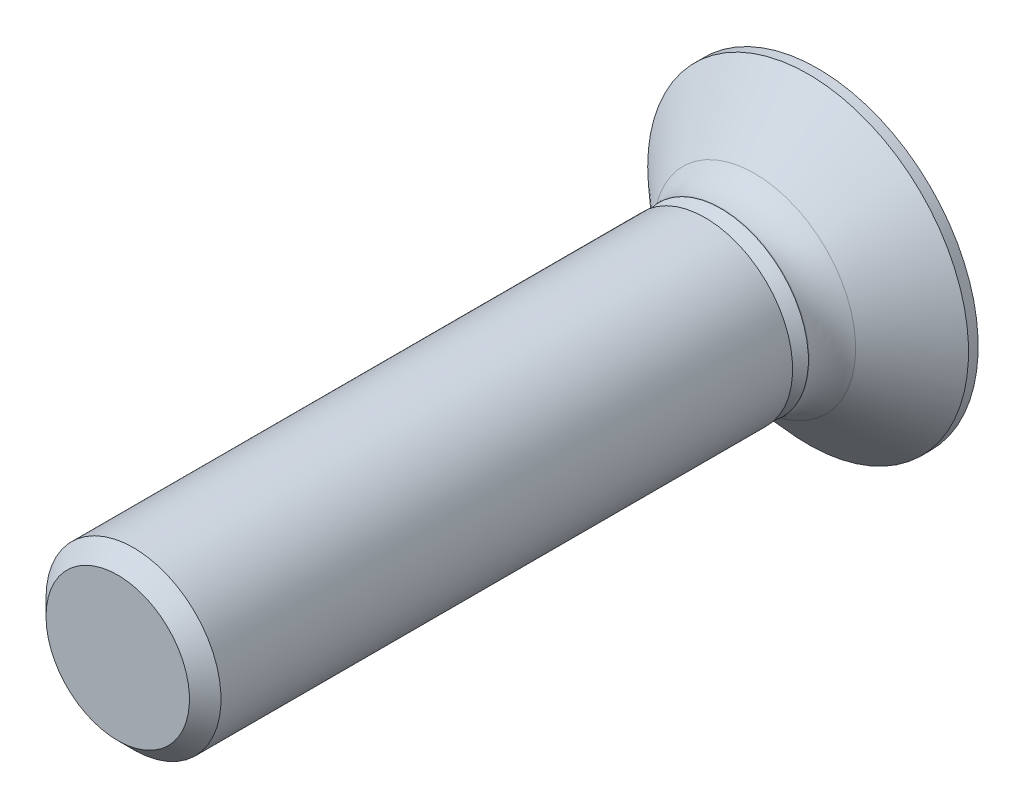
ISO-10303-21;
HEADER;
FILE_DESCRIPTION(('STEP AP214'),'2;1');
FILE_NAME('part.step','',(''),(''),'','','');
FILE_SCHEMA(('AUTOMOTIVE_DESIGN { 1 0 10303 214 1 1 1 1 }'));
ENDSEC;
DATA;
#1=APPLICATION_CONTEXT('core data for automotive mechanical design processes');
#2=APPLICATION_PROTOCOL_DEFINITION('international standard','automotive_design',2000,#1);
#3=PRODUCT_CONTEXT('',#1,'mechanical');
#4=PRODUCT('Part','Part','',(#3));
#5=PRODUCT_RELATED_PRODUCT_CATEGORY('part','',(#4));
#6=PRODUCT_DEFINITION_FORMATION('','',#4);
#7=PRODUCT_DEFINITION_CONTEXT('part definition',#1,'design');
#8=PRODUCT_DEFINITION('design','',#6,#7);
#9=PRODUCT_DEFINITION_SHAPE('','',#8);
#10=(LENGTH_UNIT() NAMED_UNIT(*) SI_UNIT(.MILLI.,.METRE.));
#11=(NAMED_UNIT(*) PLANE_ANGLE_UNIT() SI_UNIT($,.RADIAN.));
#12=(NAMED_UNIT(*) SI_UNIT($,.STERADIAN.) SOLID_ANGLE_UNIT());
#13=UNCERTAINTY_MEASURE_WITH_UNIT(LENGTH_MEASURE(1.E-05),#10,'distance_accuracy_value','');
#14=(GEOMETRIC_REPRESENTATION_CONTEXT(3) GLOBAL_UNCERTAINTY_ASSIGNED_CONTEXT((#13)) GLOBAL_UNIT_ASSIGNED_CONTEXT((#10,
#11,#12)) REPRESENTATION_CONTEXT('',''));
#15=CARTESIAN_POINT('',(0.,0.,0.));
#16=DIRECTION('',(0.,0.,1.));
#17=DIRECTION('',(1.,0.,0.));
#18=AXIS2_PLACEMENT_3D('',#15,#16,#17);
#19=CARTESIAN_POINT('',(0.,2.75,0.));
#20=DIRECTION('',(0.,0.,1.));
#21=DIRECTION('',(1.,0.,0.));
#22=AXIS2_PLACEMENT_3D('',#19,#20,#21);
#23=PLANE('',#22);
#24=CARTESIAN_POINT('',(0.,0.,0.));
#25=DIRECTION('',(0.,0.,-1.));
#26=DIRECTION('',(-1.,0.,0.));
#27=AXIS2_PLACEMENT_3D('',#24,#25,#26);
#28=CIRCLE('',#27,2.75);
#29=CARTESIAN_POINT('',(-2.75,0.,0.));
#30=VERTEX_POINT('',#29);
#31=EDGE_CURVE('E115',#30,#30,#28,.T.);
#32=ORIENTED_EDGE('',*,*,#31,.T.);
#33=EDGE_LOOP('',(#32));
#34=FACE_BOUND('',#33,.T.);
#35=DIRECTION('',(1.,0.,0.));
#36=VECTOR('',#35,1.);
#37=CARTESIAN_POINT('',(-0.475,-1.525,0.));
#38=LINE('',#37,#36);
#39=CARTESIAN_POINT('',(-0.475,-1.525,0.));
#40=VERTEX_POINT('',#39);
#41=CARTESIAN_POINT('',(0.275,-1.525,0.));
#42=VERTEX_POINT('',#41);
#43=EDGE_CURVE('E30',#40,#42,#38,.T.);
#44=ORIENTED_EDGE('',*,*,#43,.T.);
#45=DIRECTION('',(0.,1.,0.));
#46=VECTOR('',#45,1.);
#47=CARTESIAN_POINT('',(0.275,-1.525,0.));
#48=LINE('',#47,#46);
#49=CARTESIAN_POINT('',(0.275,-0.4,0.));
#50=VERTEX_POINT('',#49);
#51=EDGE_CURVE('E348',#42,#50,#48,.T.);
#52=ORIENTED_EDGE('',*,*,#51,.T.);
#53=DIRECTION('',(1.,0.,0.));
#54=VECTOR('',#53,1.);
#55=CARTESIAN_POINT('',(0.275,-0.4,0.));
#56=LINE('',#55,#54);
#57=CARTESIAN_POINT('',(1.4,-0.4,0.));
#58=VERTEX_POINT('',#57);
#59=EDGE_CURVE('E353',#50,#58,#56,.T.);
#60=ORIENTED_EDGE('',*,*,#59,.T.);
#61=DIRECTION('',(0.,1.,0.));
#62=VECTOR('',#61,1.);
#63=CARTESIAN_POINT('',(1.4,-0.4,0.));
#64=LINE('',#63,#62);
#65=CARTESIAN_POINT('',(1.4,0.35,0.));
#66=VERTEX_POINT('',#65);
#67=EDGE_CURVE('E358',#58,#66,#64,.T.);
#68=ORIENTED_EDGE('',*,*,#67,.T.);
#69=DIRECTION('',(-1.,0.,0.));
#70=VECTOR('',#69,1.);
#71=CARTESIAN_POINT('',(1.4,0.35,0.));
#72=LINE('',#71,#70);
#73=CARTESIAN_POINT('',(0.275,0.35,0.));
#74=VERTEX_POINT('',#73);
#75=EDGE_CURVE('E363',#66,#74,#72,.T.);
#76=ORIENTED_EDGE('',*,*,#75,.T.);
#77=DIRECTION('',(0.,1.,0.));
#78=VECTOR('',#77,1.);
#79=CARTESIAN_POINT('',(0.275,0.35,0.));
#80=LINE('',#79,#78);
#81=CARTESIAN_POINT('',(0.275,1.475,0.));
#82=VERTEX_POINT('',#81);
#83=EDGE_CURVE('E368',#74,#82,#80,.T.);
#84=ORIENTED_EDGE('',*,*,#83,.T.);
#85=DIRECTION('',(-1.,0.,0.));
#86=VECTOR('',#85,1.);
#87=CARTESIAN_POINT('',(0.275,1.475,0.));
#88=LINE('',#87,#86);
#89=CARTESIAN_POINT('',(-0.475,1.475,0.));
#90=VERTEX_POINT('',#89);
#91=EDGE_CURVE('E373',#82,#90,#88,.T.);
#92=ORIENTED_EDGE('',*,*,#91,.T.);
#93=DIRECTION('',(0.,-1.,0.));
#94=VECTOR('',#93,1.);
#95=CARTESIAN_POINT('',(-0.475,1.475,0.));
#96=LINE('',#95,#94);
#97=CARTESIAN_POINT('',(-0.475,0.35,0.));
#98=VERTEX_POINT('',#97);
#99=EDGE_CURVE('E378',#90,#98,#96,.T.);
#100=ORIENTED_EDGE('',*,*,#99,.T.);
#101=DIRECTION('',(-1.,0.,0.));
#102=VECTOR('',#101,1.);
#103=CARTESIAN_POINT('',(-0.475,0.35,0.));
#104=LINE('',#103,#102);
#105=CARTESIAN_POINT('',(-1.6,0.35,0.));
#106=VERTEX_POINT('',#105);
#107=EDGE_CURVE('E383',#98,#106,#104,.T.);
#108=ORIENTED_EDGE('',*,*,#107,.T.);
#109=DIRECTION('',(0.,-1.,0.));
#110=VECTOR('',#109,1.);
#111=CARTESIAN_POINT('',(-1.6,0.35,0.));
#112=LINE('',#111,#110);
#113=CARTESIAN_POINT('',(-1.6,-0.4,0.));
#114=VERTEX_POINT('',#113);
#115=EDGE_CURVE('E388',#106,#114,#112,.T.);
#116=ORIENTED_EDGE('',*,*,#115,.T.);
#117=DIRECTION('',(1.,0.,0.));
#118=VECTOR('',#117,1.);
#119=CARTESIAN_POINT('',(-1.6,-0.4,0.));
#120=LINE('',#119,#118);
#121=CARTESIAN_POINT('',(-0.475,-0.4,0.));
#122=VERTEX_POINT('',#121);
#123=EDGE_CURVE('E97',#114,#122,#120,.T.);
#124=ORIENTED_EDGE('',*,*,#123,.T.);
#125=DIRECTION('',(0.,-1.,0.));
#126=VECTOR('',#125,1.);
#127=CARTESIAN_POINT('',(-0.475,-0.4,0.));
#128=LINE('',#127,#126);
#129=EDGE_CURVE('E395',#122,#40,#128,.T.);
#130=ORIENTED_EDGE('',*,*,#129,.T.);
#131=EDGE_LOOP('',(#44,#52,#60,#68,#76,#84,#92,#100,#108,#116,#124,#130));
#132=FACE_BOUND('',#131,.T.);
#133=ADVANCED_FACE('F15',(#34,#132),#23,.F.);
#134=CARTESIAN_POINT('',(0.,0.,12.));
#135=DIRECTION('',(0.,0.,-1.));
#136=DIRECTION('',(-1.,0.,0.));
#137=AXIS2_PLACEMENT_3D('',#134,#135,#136);
#138=PLANE('',#137);
#139=CARTESIAN_POINT('',(0.,0.,12.));
#140=DIRECTION('',(0.,0.,-1.));
#141=DIRECTION('',(-1.,0.,0.));
#142=AXIS2_PLACEMENT_3D('',#139,#140,#141);
#143=CIRCLE('',#142,1.229375);
#144=CARTESIAN_POINT('',(-1.229375,0.,12.));
#145=VERTEX_POINT('',#144);
#146=EDGE_CURVE('E10',#145,#145,#143,.T.);
#147=ORIENTED_EDGE('',*,*,#146,.F.);
#148=EDGE_LOOP('',(#147));
#149=FACE_BOUND('',#148,.T.);
#150=ADVANCED_FACE('F155',(#149),#138,.F.);
#151=CARTESIAN_POINT('',(0.,0.,12.));
#152=DIRECTION('',(0.,0.,-1.));
#153=DIRECTION('',(-1.,0.,0.));
#154=AXIS2_PLACEMENT_3D('',#151,#152,#153);
#155=CONICAL_SURFACE('',#154,1.229375,0.785398163397449);
#156=CARTESIAN_POINT('',(0.,0.,11.729375));
#157=DIRECTION('',(0.,0.,-1.));
#158=DIRECTION('',(-1.,0.,0.));
#159=AXIS2_PLACEMENT_3D('',#156,#157,#158);
#160=CIRCLE('',#159,1.5);
#161=CARTESIAN_POINT('',(-1.5,0.,11.729375));
#162=VERTEX_POINT('',#161);
#163=EDGE_CURVE('E23',#162,#162,#160,.T.);
#164=ORIENTED_EDGE('',*,*,#163,.F.);
#165=EDGE_LOOP('',(#164));
#166=FACE_BOUND('',#165,.T.);
#167=ORIENTED_EDGE('',*,*,#146,.T.);
#168=EDGE_LOOP('',(#167));
#169=FACE_BOUND('',#168,.T.);
#170=ADVANCED_FACE('F152',(#166,#169),#155,.T.);
#171=CARTESIAN_POINT('',(0.,0.,0.));
#172=DIRECTION('',(0.,0.,-1.));
#173=DIRECTION('',(-1.,0.,0.));
#174=AXIS2_PLACEMENT_3D('',#171,#172,#173);
#175=CYLINDRICAL_SURFACE('',#174,1.5);
#176=CARTESIAN_POINT('',(0.,0.,1.930625));
#177=DIRECTION('',(0.,0.,-1.));
#178=DIRECTION('',(-1.,0.,0.));
#179=AXIS2_PLACEMENT_3D('',#176,#177,#178);
#180=CIRCLE('',#179,1.5);
#181=CARTESIAN_POINT('',(-1.5,0.,1.930625));
#182=VERTEX_POINT('',#181);
#183=EDGE_CURVE('E140',#182,#182,#180,.T.);
#184=ORIENTED_EDGE('',*,*,#183,.F.);
#185=EDGE_LOOP('',(#184));
#186=FACE_BOUND('',#185,.T.);
#187=ORIENTED_EDGE('',*,*,#163,.T.);
#188=EDGE_LOOP('',(#187));
#189=FACE_BOUND('',#188,.T.);
#190=ADVANCED_FACE('F150',(#186,#189),#175,.T.);
#191=CARTESIAN_POINT('',(0.,1.5,1.930625));
#192=DIRECTION('',(0.,0.,1.));
#193=DIRECTION('',(1.,0.,0.));
#194=AXIS2_PLACEMENT_3D('',#191,#192,#193);
#195=PLANE('',#194);
#196=CARTESIAN_POINT('',(0.,0.,1.930625));
#197=DIRECTION('',(0.,0.,-1.));
#198=DIRECTION('',(-1.,0.,0.));
#199=AXIS2_PLACEMENT_3D('',#196,#197,#198);
#200=CIRCLE('',#199,1.229375);
#201=CARTESIAN_POINT('',(-1.229375,0.,1.930625));
#202=VERTEX_POINT('',#201);
#203=EDGE_CURVE('E136',#202,#202,#200,.T.);
#204=ORIENTED_EDGE('',*,*,#203,.F.);
#205=EDGE_LOOP('',(#204));
#206=FACE_BOUND('',#205,.T.);
#207=ORIENTED_EDGE('',*,*,#183,.T.);
#208=EDGE_LOOP('',(#207));
#209=FACE_BOUND('',#208,.T.);
#210=ADVANCED_FACE('F168',(#206,#209),#195,.F.);
#211=CARTESIAN_POINT('',(0.,0.,1.930625));
#212=DIRECTION('',(0.,0.,-1.));
#213=DIRECTION('',(-1.,0.,0.));
#214=AXIS2_PLACEMENT_3D('',#211,#212,#213);
#215=CONICAL_SURFACE('',#214,1.229375,0.785398163397449);
#216=CARTESIAN_POINT('',(0.,0.,1.66));
#217=DIRECTION('',(0.,0.,-1.));
#218=DIRECTION('',(-1.,0.,0.));
#219=AXIS2_PLACEMENT_3D('',#216,#217,#218);
#220=CIRCLE('',#219,1.5);
#221=CARTESIAN_POINT('',(-1.5,0.,1.66));
#222=VERTEX_POINT('',#221);
#223=EDGE_CURVE('E132',#222,#222,#220,.T.);
#224=ORIENTED_EDGE('',*,*,#223,.F.);
#225=EDGE_LOOP('',(#224));
#226=FACE_BOUND('',#225,.T.);
#227=ORIENTED_EDGE('',*,*,#203,.T.);
#228=EDGE_LOOP('',(#227));
#229=FACE_BOUND('',#228,.T.);
#230=ADVANCED_FACE('F172',(#226,#229),#215,.T.);
#231=CARTESIAN_POINT('',(0.,0.,0.));
#232=DIRECTION('',(0.,0.,-1.));
#233=DIRECTION('',(-1.,0.,0.));
#234=AXIS2_PLACEMENT_3D('',#231,#232,#233);
#235=CYLINDRICAL_SURFACE('',#234,1.5);
#236=CARTESIAN_POINT('',(0.,0.,1.65));
#237=DIRECTION('',(0.,0.,-1.));
#238=DIRECTION('',(-1.,0.,0.));
#239=AXIS2_PLACEMENT_3D('',#236,#237,#238);
#240=CIRCLE('',#239,1.5);
#241=CARTESIAN_POINT('',(-1.5,0.,1.65));
#242=VERTEX_POINT('',#241);
#243=EDGE_CURVE('E128',#242,#242,#240,.T.);
#244=ORIENTED_EDGE('',*,*,#243,.F.);
#245=EDGE_LOOP('',(#244));
#246=FACE_BOUND('',#245,.T.);
#247=ORIENTED_EDGE('',*,*,#223,.T.);
#248=EDGE_LOOP('',(#247));
#249=FACE_BOUND('',#248,.T.);
#250=ADVANCED_FACE('F176',(#246,#249),#235,.T.);
#251=CARTESIAN_POINT('',(0.,0.,1.65));
#252=DIRECTION('',(0.,0.,-1.));
#253=DIRECTION('',(-1.,0.,0.));
#254=AXIS2_PLACEMENT_3D('',#251,#252,#253);
#255=TOROIDAL_SURFACE('',#254,2.3,0.8);
#256=ORIENTED_EDGE('',*,*,#243,.T.);
#257=EDGE_LOOP('',(#256));
#258=FACE_BOUND('',#257,.T.);
#259=CARTESIAN_POINT('',(0.,0.,1.08431457505076));
#260=DIRECTION('',(0.,0.,-1.));
#261=DIRECTION('',(-1.,0.,0.));
#262=AXIS2_PLACEMENT_3D('',#259,#260,#261);
#263=CIRCLE('',#262,1.73431457505076);
#264=CARTESIAN_POINT('',(-1.73431457505076,0.,1.08431457505076));
#265=VERTEX_POINT('',#264);
#266=EDGE_CURVE('E124',#265,#265,#263,.T.);
#267=ORIENTED_EDGE('',*,*,#266,.F.);
#268=EDGE_LOOP('',(#267));
#269=FACE_BOUND('',#268,.T.);
#270=ADVANCED_FACE('F180',(#258,#269),#255,.F.);
#271=CARTESIAN_POINT('',(0.,0.,1.08431457505076));
#272=DIRECTION('',(0.,0.,-1.));
#273=DIRECTION('',(-1.,0.,0.));
#274=AXIS2_PLACEMENT_3D('',#271,#272,#273);
#275=CONICAL_SURFACE('',#274,1.73431457505076,0.835161102643237);
#276=CARTESIAN_POINT('',(0.,0.,0.165));
#277=DIRECTION('',(0.,0.,-1.));
#278=DIRECTION('',(-1.,0.,0.));
#279=AXIS2_PLACEMENT_3D('',#276,#277,#278);
#280=CIRCLE('',#279,2.75);
#281=CARTESIAN_POINT('',(-2.75,0.,0.165));
#282=VERTEX_POINT('',#281);
#283=EDGE_CURVE('E119',#282,#282,#280,.T.);
#284=ORIENTED_EDGE('',*,*,#283,.F.);
#285=EDGE_LOOP('',(#284));
#286=FACE_BOUND('',#285,.T.);
#287=ORIENTED_EDGE('',*,*,#266,.T.);
#288=EDGE_LOOP('',(#287));
#289=FACE_BOUND('',#288,.T.);
#290=ADVANCED_FACE('F184',(#286,#289),#275,.T.);
#291=CARTESIAN_POINT('',(0.,0.,0.));
#292=DIRECTION('',(0.,0.,-1.));
#293=DIRECTION('',(-1.,0.,0.));
#294=AXIS2_PLACEMENT_3D('',#291,#292,#293);
#295=CYLINDRICAL_SURFACE('',#294,2.75);
#296=ORIENTED_EDGE('',*,*,#31,.F.);
#297=EDGE_LOOP('',(#296));
#298=FACE_BOUND('',#297,.T.);
#299=ORIENTED_EDGE('',*,*,#283,.T.);
#300=EDGE_LOOP('',(#299));
#301=FACE_BOUND('',#300,.T.);
#302=ADVANCED_FACE('F188',(#298,#301),#295,.T.);
#303=CARTESIAN_POINT('',(-0.475,-1.525,0.));
#304=DIRECTION('',(0.,-0.984807753012208,0.17364817766693));
#305=DIRECTION('',(0.,-0.17364817766693,-0.984807753012208));
#306=AXIS2_PLACEMENT_3D('',#303,#304,#305);
#307=PLANE('',#306);
#308=ORIENTED_EDGE('',*,*,#43,.F.);
#309=DIRECTION('',(-0.171087869746036,-0.171087869746036,-0.970287525247814));
#310=VECTOR('',#309,1.);
#311=CARTESIAN_POINT('',(-0.475,-1.525,0.));
#312=LINE('',#311,#310);
#313=CARTESIAN_POINT('',(-0.164664513953102,-1.2146645139531,1.76));
#314=VERTEX_POINT('',#313);
#315=EDGE_CURVE('E111',#314,#40,#312,.T.);
#316=ORIENTED_EDGE('',*,*,#315,.F.);
#317=DIRECTION('',(-1.,0.,0.));
#318=VECTOR('',#317,1.);
#319=CARTESIAN_POINT('',(-0.475,-1.2146645139531,1.76));
#320=LINE('',#319,#318);
#321=CARTESIAN_POINT('',(-0.0353354860468985,-1.2146645139531,1.76));
#322=VERTEX_POINT('',#321);
#323=EDGE_CURVE('E399',#314,#322,#320,.F.);
#324=ORIENTED_EDGE('',*,*,#323,.T.);
#325=DIRECTION('',(0.171087869746036,-0.171087869746036,-0.970287525247814));
#326=VECTOR('',#325,1.);
#327=CARTESIAN_POINT('',(0.275,-1.525,0.));
#328=LINE('',#327,#326);
#329=EDGE_CURVE('E120',#322,#42,#328,.T.);
#330=ORIENTED_EDGE('',*,*,#329,.T.);
#331=EDGE_LOOP('',(#308,#316,#324,#330));
#332=FACE_BOUND('',#331,.T.);
#333=ADVANCED_FACE('F192',(#332),#307,.F.);
#334=CARTESIAN_POINT('',(0.275,-1.525,0.));
#335=DIRECTION('',(0.984807753012208,0.,0.17364817766693));
#336=DIRECTION('',(0.17364817766693,0.,-0.984807753012208));
#337=AXIS2_PLACEMENT_3D('',#334,#335,#336);
#338=PLANE('',#337);
#339=ORIENTED_EDGE('',*,*,#51,.F.);
#340=ORIENTED_EDGE('',*,*,#329,.F.);
#341=DIRECTION('',(0.,-1.,0.));
#342=VECTOR('',#341,1.);
#343=CARTESIAN_POINT('',(-0.0353354860468988,-1.525,1.76));
#344=LINE('',#343,#342);
#345=CARTESIAN_POINT('',(-0.0353354860468985,-0.0896645139531017,1.76));
#346=VERTEX_POINT('',#345);
#347=EDGE_CURVE('E408',#322,#346,#344,.F.);
#348=ORIENTED_EDGE('',*,*,#347,.T.);
#349=DIRECTION('',(0.171087869746036,-0.171087869746036,-0.970287525247814));
#350=VECTOR('',#349,1.);
#351=CARTESIAN_POINT('',(0.307929941571016,-0.432929941571016,-0.186754978952777));
#352=LINE('',#351,#350);
#353=EDGE_CURVE('E440',#346,#50,#352,.T.);
#354=ORIENTED_EDGE('',*,*,#353,.T.);
#355=EDGE_LOOP('',(#339,#340,#348,#354));
#356=FACE_BOUND('',#355,.T.);
#357=ADVANCED_FACE('F196',(#356),#338,.F.);
#358=CARTESIAN_POINT('',(0.275,-0.4,0.));
#359=DIRECTION('',(0.,-0.984807753012208,0.17364817766693));
#360=DIRECTION('',(0.,-0.17364817766693,-0.984807753012208));
#361=AXIS2_PLACEMENT_3D('',#358,#359,#360);
#362=PLANE('',#361);
#363=ORIENTED_EDGE('',*,*,#59,.F.);
#364=ORIENTED_EDGE('',*,*,#353,.F.);
#365=DIRECTION('',(-1.,0.,0.));
#366=VECTOR('',#365,1.);
#367=CARTESIAN_POINT('',(0.275,-0.0896645139531017,1.76));
#368=LINE('',#367,#366);
#369=CARTESIAN_POINT('',(1.0896645139531,-0.0896645139531017,1.76));
#370=VERTEX_POINT('',#369);
#371=EDGE_CURVE('E448',#346,#370,#368,.F.);
#372=ORIENTED_EDGE('',*,*,#371,.T.);
#373=DIRECTION('',(0.171087869746036,-0.171087869746036,-0.970287525247814));
#374=VECTOR('',#373,1.);
#375=CARTESIAN_POINT('',(1.4,-0.4,0.));
#376=LINE('',#375,#374);
#377=EDGE_CURVE('E436',#370,#58,#376,.T.);
#378=ORIENTED_EDGE('',*,*,#377,.T.);
#379=EDGE_LOOP('',(#363,#364,#372,#378));
#380=FACE_BOUND('',#379,.T.);
#381=ADVANCED_FACE('F199',(#380),#362,.F.);
#382=CARTESIAN_POINT('',(1.4,-0.4,0.));
#383=DIRECTION('',(0.984807753012208,0.,0.17364817766693));
#384=DIRECTION('',(0.17364817766693,0.,-0.984807753012208));
#385=AXIS2_PLACEMENT_3D('',#382,#383,#384);
#386=PLANE('',#385);
#387=ORIENTED_EDGE('',*,*,#67,.F.);
#388=ORIENTED_EDGE('',*,*,#377,.F.);
#389=DIRECTION('',(0.,-1.,0.));
#390=VECTOR('',#389,1.);
#391=CARTESIAN_POINT('',(1.0896645139531,-0.4,1.76));
#392=LINE('',#391,#390);
#393=CARTESIAN_POINT('',(1.0896645139531,0.0396645139531017,1.76));
#394=VERTEX_POINT('',#393);
#395=EDGE_CURVE('E451',#370,#394,#392,.F.);
#396=ORIENTED_EDGE('',*,*,#395,.T.);
#397=DIRECTION('',(0.171087869746036,0.171087869746036,-0.970287525247814));
#398=VECTOR('',#397,1.);
#399=CARTESIAN_POINT('',(1.4,0.35,0.));
#400=LINE('',#399,#398);
#401=EDGE_CURVE('E432',#394,#66,#400,.T.);
#402=ORIENTED_EDGE('',*,*,#401,.T.);
#403=EDGE_LOOP('',(#387,#388,#396,#402));
#404=FACE_BOUND('',#403,.T.);
#405=ADVANCED_FACE('F203',(#404),#386,.F.);
#406=CARTESIAN_POINT('',(1.4,0.35,0.));
#407=DIRECTION('',(0.,0.984807753012208,0.17364817766693));
#408=DIRECTION('',(0.,-0.17364817766693,0.984807753012208));
#409=AXIS2_PLACEMENT_3D('',#406,#407,#408);
#410=PLANE('',#409);
#411=ORIENTED_EDGE('',*,*,#75,.F.);
#412=ORIENTED_EDGE('',*,*,#401,.F.);
#413=DIRECTION('',(1.,0.,0.));
#414=VECTOR('',#413,1.);
#415=CARTESIAN_POINT('',(1.4,0.0396645139531017,1.76));
#416=LINE('',#415,#414);
#417=CARTESIAN_POINT('',(-0.0353354860468985,0.0396645139531017,1.76));
#418=VERTEX_POINT('',#417);
#419=EDGE_CURVE('E454',#394,#418,#416,.F.);
#420=ORIENTED_EDGE('',*,*,#419,.T.);
#421=DIRECTION('',(0.171087869746036,0.171087869746036,-0.970287525247814));
#422=VECTOR('',#421,1.);
#423=CARTESIAN_POINT('',(0.307929941571016,0.382929941571016,-0.186754978952777));
#424=LINE('',#423,#422);
#425=EDGE_CURVE('E428',#418,#74,#424,.T.);
#426=ORIENTED_EDGE('',*,*,#425,.T.);
#427=EDGE_LOOP('',(#411,#412,#420,#426));
#428=FACE_BOUND('',#427,.T.);
#429=ADVANCED_FACE('F207',(#428),#410,.F.);
#430=CARTESIAN_POINT('',(0.275,0.35,0.));
#431=DIRECTION('',(0.984807753012208,0.,0.17364817766693));
#432=DIRECTION('',(0.17364817766693,0.,-0.984807753012208));
#433=AXIS2_PLACEMENT_3D('',#430,#431,#432);
#434=PLANE('',#433);
#435=ORIENTED_EDGE('',*,*,#83,.F.);
#436=ORIENTED_EDGE('',*,*,#425,.F.);
#437=DIRECTION('',(0.,-1.,0.));
#438=VECTOR('',#437,1.);
#439=CARTESIAN_POINT('',(-0.0353354860468988,0.35,1.76));
#440=LINE('',#439,#438);
#441=CARTESIAN_POINT('',(-0.0353354860468985,1.1646645139531,1.76));
#442=VERTEX_POINT('',#441);
#443=EDGE_CURVE('E457',#418,#442,#440,.F.);
#444=ORIENTED_EDGE('',*,*,#443,.T.);
#445=DIRECTION('',(0.171087869746036,0.171087869746036,-0.970287525247814));
#446=VECTOR('',#445,1.);
#447=CARTESIAN_POINT('',(0.275,1.475,0.));
#448=LINE('',#447,#446);
#449=EDGE_CURVE('E424',#442,#82,#448,.T.);
#450=ORIENTED_EDGE('',*,*,#449,.T.);
#451=EDGE_LOOP('',(#435,#436,#444,#450));
#452=FACE_BOUND('',#451,.T.);
#453=ADVANCED_FACE('F211',(#452),#434,.F.);
#454=CARTESIAN_POINT('',(0.275,1.475,0.));
#455=DIRECTION('',(0.,0.984807753012208,0.17364817766693));
#456=DIRECTION('',(0.,-0.17364817766693,0.984807753012208));
#457=AXIS2_PLACEMENT_3D('',#454,#455,#456);
#458=PLANE('',#457);
#459=ORIENTED_EDGE('',*,*,#91,.F.);
#460=ORIENTED_EDGE('',*,*,#449,.F.);
#461=DIRECTION('',(1.,0.,0.));
#462=VECTOR('',#461,1.);
#463=CARTESIAN_POINT('',(0.275,1.1646645139531,1.76));
#464=LINE('',#463,#462);
#465=CARTESIAN_POINT('',(-0.164664513953102,1.1646645139531,1.76));
#466=VERTEX_POINT('',#465);
#467=EDGE_CURVE('E460',#442,#466,#464,.F.);
#468=ORIENTED_EDGE('',*,*,#467,.T.);
#469=DIRECTION('',(-0.171087869746036,0.171087869746036,-0.970287525247814));
#470=VECTOR('',#469,1.);
#471=CARTESIAN_POINT('',(-0.475,1.475,0.));
#472=LINE('',#471,#470);
#473=EDGE_CURVE('E420',#466,#90,#472,.T.);
#474=ORIENTED_EDGE('',*,*,#473,.T.);
#475=EDGE_LOOP('',(#459,#460,#468,#474));
#476=FACE_BOUND('',#475,.T.);
#477=ADVANCED_FACE('F215',(#476),#458,.F.);
#478=CARTESIAN_POINT('',(-0.475,1.475,0.));
#479=DIRECTION('',(-0.984807753012208,0.,0.17364817766693));
#480=DIRECTION('',(0.17364817766693,0.,0.984807753012208));
#481=AXIS2_PLACEMENT_3D('',#478,#479,#480);
#482=PLANE('',#481);
#483=ORIENTED_EDGE('',*,*,#99,.F.);
#484=ORIENTED_EDGE('',*,*,#473,.F.);
#485=DIRECTION('',(0.,1.,0.));
#486=VECTOR('',#485,1.);
#487=CARTESIAN_POINT('',(-0.164664513953102,1.475,1.76));
#488=LINE('',#487,#486);
#489=CARTESIAN_POINT('',(-0.164664513953102,0.0396645139531015,1.76));
#490=VERTEX_POINT('',#489);
#491=EDGE_CURVE('E463',#466,#490,#488,.F.);
#492=ORIENTED_EDGE('',*,*,#491,.T.);
#493=DIRECTION('',(-0.171087869746036,0.171087869746036,-0.970287525247814));
#494=VECTOR('',#493,1.);
#495=CARTESIAN_POINT('',(-0.507929941571016,0.382929941571016,-0.186754978952777));
#496=LINE('',#495,#494);
#497=EDGE_CURVE('E416',#490,#98,#496,.T.);
#498=ORIENTED_EDGE('',*,*,#497,.T.);
#499=EDGE_LOOP('',(#483,#484,#492,#498));
#500=FACE_BOUND('',#499,.T.);
#501=ADVANCED_FACE('F219',(#500),#482,.F.);
#502=CARTESIAN_POINT('',(-0.475,0.35,0.));
#503=DIRECTION('',(0.,0.984807753012208,0.17364817766693));
#504=DIRECTION('',(0.,-0.17364817766693,0.984807753012208));
#505=AXIS2_PLACEMENT_3D('',#502,#503,#504);
#506=PLANE('',#505);
#507=ORIENTED_EDGE('',*,*,#107,.F.);
#508=ORIENTED_EDGE('',*,*,#497,.F.);
#509=DIRECTION('',(1.,0.,0.));
#510=VECTOR('',#509,1.);
#511=CARTESIAN_POINT('',(-0.475,0.0396645139531016,1.76));
#512=LINE('',#511,#510);
#513=CARTESIAN_POINT('',(-1.2896645139531,0.0396645139531016,1.76));
#514=VERTEX_POINT('',#513);
#515=EDGE_CURVE('E91',#490,#514,#512,.F.);
#516=ORIENTED_EDGE('',*,*,#515,.T.);
#517=DIRECTION('',(-0.171087869746036,0.171087869746036,-0.970287525247814));
#518=VECTOR('',#517,1.);
#519=CARTESIAN_POINT('',(-1.6,0.35,0.));
#520=LINE('',#519,#518);
#521=EDGE_CURVE('E85',#514,#106,#520,.T.);
#522=ORIENTED_EDGE('',*,*,#521,.T.);
#523=EDGE_LOOP('',(#507,#508,#516,#522));
#524=FACE_BOUND('',#523,.T.);
#525=ADVANCED_FACE('F223',(#524),#506,.F.);
#526=CARTESIAN_POINT('',(-1.6,0.35,0.));
#527=DIRECTION('',(-0.984807753012208,0.,0.17364817766693));
#528=DIRECTION('',(0.17364817766693,0.,0.984807753012208));
#529=AXIS2_PLACEMENT_3D('',#526,#527,#528);
#530=PLANE('',#529);
#531=ORIENTED_EDGE('',*,*,#115,.F.);
#532=ORIENTED_EDGE('',*,*,#521,.F.);
#533=DIRECTION('',(0.,1.,0.));
#534=VECTOR('',#533,1.);
#535=CARTESIAN_POINT('',(-1.2896645139531,0.35,1.76));
#536=LINE('',#535,#534);
#537=CARTESIAN_POINT('',(-1.2896645139531,-0.0896645139531017,1.76));
#538=VERTEX_POINT('',#537);
#539=EDGE_CURVE('E77',#514,#538,#536,.F.);
#540=ORIENTED_EDGE('',*,*,#539,.T.);
#541=DIRECTION('',(-0.171087869746036,-0.171087869746036,-0.970287525247814));
#542=VECTOR('',#541,1.);
#543=CARTESIAN_POINT('',(-1.6,-0.4,0.));
#544=LINE('',#543,#542);
#545=EDGE_CURVE('E82',#538,#114,#544,.T.);
#546=ORIENTED_EDGE('',*,*,#545,.T.);
#547=EDGE_LOOP('',(#531,#532,#540,#546));
#548=FACE_BOUND('',#547,.T.);
#549=ADVANCED_FACE('F80',(#548),#530,.F.);
#550=CARTESIAN_POINT('',(-1.6,-0.4,0.));
#551=DIRECTION('',(0.,-0.984807753012208,0.17364817766693));
#552=DIRECTION('',(0.,-0.17364817766693,-0.984807753012208));
#553=AXIS2_PLACEMENT_3D('',#550,#551,#552);
#554=PLANE('',#553);
#555=ORIENTED_EDGE('',*,*,#123,.F.);
#556=ORIENTED_EDGE('',*,*,#545,.F.);
#557=DIRECTION('',(-1.,0.,0.));
#558=VECTOR('',#557,1.);
#559=CARTESIAN_POINT('',(-1.6,-0.0896645139531017,1.76));
#560=LINE('',#559,#558);
#561=CARTESIAN_POINT('',(-0.164664513953102,-0.0896645139531017,1.76));
#562=VERTEX_POINT('',#561);
#563=EDGE_CURVE('E90',#538,#562,#560,.F.);
#564=ORIENTED_EDGE('',*,*,#563,.T.);
#565=DIRECTION('',(-0.171087869746036,-0.171087869746036,-0.970287525247814));
#566=VECTOR('',#565,1.);
#567=CARTESIAN_POINT('',(-0.507929941571016,-0.432929941571016,-0.186754978952777));
#568=LINE('',#567,#566);
#569=EDGE_CURVE('E100',#562,#122,#568,.T.);
#570=ORIENTED_EDGE('',*,*,#569,.T.);
#571=EDGE_LOOP('',(#555,#556,#564,#570));
#572=FACE_BOUND('',#571,.T.);
#573=ADVANCED_FACE('F94',(#572),#554,.F.);
#574=CARTESIAN_POINT('',(-0.475,-0.4,0.));
#575=DIRECTION('',(-0.984807753012208,0.,0.17364817766693));
#576=DIRECTION('',(0.17364817766693,0.,0.984807753012208));
#577=AXIS2_PLACEMENT_3D('',#574,#575,#576);
#578=PLANE('',#577);
#579=ORIENTED_EDGE('',*,*,#129,.F.);
#580=ORIENTED_EDGE('',*,*,#569,.F.);
#581=DIRECTION('',(0.,1.,0.));
#582=VECTOR('',#581,1.);
#583=CARTESIAN_POINT('',(-0.164664513953102,-0.4,1.76));
#584=LINE('',#583,#582);
#585=EDGE_CURVE('E38',#562,#314,#584,.F.);
#586=ORIENTED_EDGE('',*,*,#585,.T.);
#587=ORIENTED_EDGE('',*,*,#315,.T.);
#588=EDGE_LOOP('',(#579,#580,#586,#587));
#589=FACE_BOUND('',#588,.T.);
#590=ADVANCED_FACE('F232',(#589),#578,.F.);
#591=CARTESIAN_POINT('',(0.275,-1.525,1.76));
#592=DIRECTION('',(0.,0.,1.));
#593=DIRECTION('',(1.,0.,0.));
#594=AXIS2_PLACEMENT_3D('',#591,#592,#593);
#595=PLANE('',#594);
#596=ORIENTED_EDGE('',*,*,#323,.F.);
#597=ORIENTED_EDGE('',*,*,#585,.F.);
#598=ORIENTED_EDGE('',*,*,#563,.F.);
#599=ORIENTED_EDGE('',*,*,#539,.F.);
#600=ORIENTED_EDGE('',*,*,#515,.F.);
#601=ORIENTED_EDGE('',*,*,#491,.F.);
#602=ORIENTED_EDGE('',*,*,#467,.F.);
#603=ORIENTED_EDGE('',*,*,#443,.F.);
#604=ORIENTED_EDGE('',*,*,#419,.F.);
#605=ORIENTED_EDGE('',*,*,#395,.F.);
#606=ORIENTED_EDGE('',*,*,#371,.F.);
#607=ORIENTED_EDGE('',*,*,#347,.F.);
#608=EDGE_LOOP('',(#596,#597,#598,#599,#600,#601,#602,#603,#604,#605,#606,#607));
#609=FACE_BOUND('',#608,.T.);
#610=ADVANCED_FACE('F103',(#609),#595,.F.);
#611=CLOSED_SHELL('',(#133,#150,#170,#190,#210,#230,#250,#270,#290,#302,#333,#357,#381,#405,
#429,#453,#477,#501,#525,#549,#573,#590,#610));
#612=MANIFOLD_SOLID_BREP('B1',#611);
#613=ADVANCED_BREP_SHAPE_REPRESENTATION('',(#18,#612),#14);
#614=SHAPE_DEFINITION_REPRESENTATION(#9,#613);
ENDSEC;
END-ISO-10303-21;
